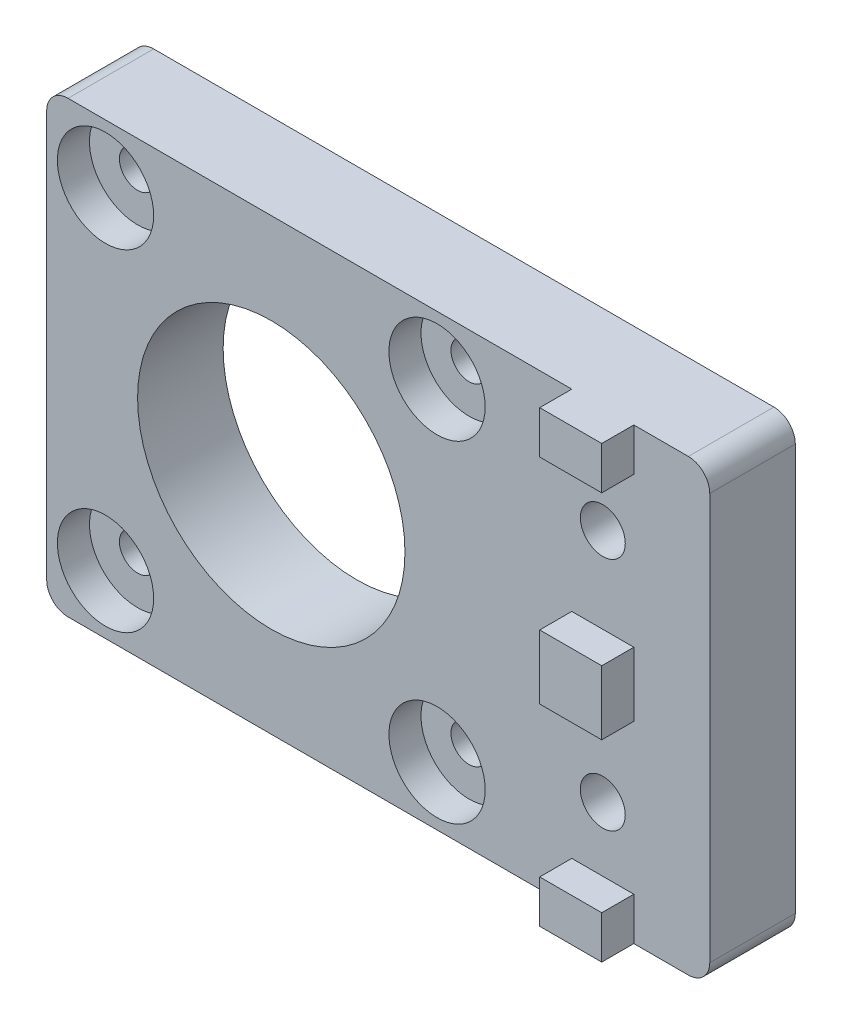
ISO-10303-21;
HEADER;
FILE_DESCRIPTION(('STEP AP214'),'2;1');
FILE_NAME('part.step','',(''),(''),'','','');
FILE_SCHEMA(('AUTOMOTIVE_DESIGN { 1 0 10303 214 1 1 1 1 }'));
ENDSEC;
DATA;
#1=APPLICATION_CONTEXT('core data for automotive mechanical design processes');
#2=APPLICATION_PROTOCOL_DEFINITION('international standard','automotive_design',2000,#1);
#3=PRODUCT_CONTEXT('',#1,'mechanical');
#4=PRODUCT('Part','Part','',(#3));
#5=PRODUCT_RELATED_PRODUCT_CATEGORY('part','',(#4));
#6=PRODUCT_DEFINITION_FORMATION('','',#4);
#7=PRODUCT_DEFINITION_CONTEXT('part definition',#1,'design');
#8=PRODUCT_DEFINITION('design','',#6,#7);
#9=PRODUCT_DEFINITION_SHAPE('','',#8);
#10=(LENGTH_UNIT() NAMED_UNIT(*) SI_UNIT(.MILLI.,.METRE.));
#11=(NAMED_UNIT(*) PLANE_ANGLE_UNIT() SI_UNIT($,.RADIAN.));
#12=(NAMED_UNIT(*) SI_UNIT($,.STERADIAN.) SOLID_ANGLE_UNIT());
#13=UNCERTAINTY_MEASURE_WITH_UNIT(LENGTH_MEASURE(1.E-05),#10,'distance_accuracy_value','');
#14=(GEOMETRIC_REPRESENTATION_CONTEXT(3) GLOBAL_UNCERTAINTY_ASSIGNED_CONTEXT((#13)) GLOBAL_UNIT_ASSIGNED_CONTEXT((#10,
#11,#12)) REPRESENTATION_CONTEXT('',''));
#15=CARTESIAN_POINT('',(0.,0.,0.));
#16=DIRECTION('',(0.,0.,1.));
#17=DIRECTION('',(1.,0.,0.));
#18=AXIS2_PLACEMENT_3D('',#15,#16,#17);
#19=CARTESIAN_POINT('',(5.5,15.5,0.));
#20=DIRECTION('',(0.,0.,1.));
#21=DIRECTION('',(1.,0.,0.));
#22=AXIS2_PLACEMENT_3D('',#19,#20,#21);
#23=CYLINDRICAL_SURFACE('',#22,1.7);
#24=CARTESIAN_POINT('',(5.5,15.5,0.));
#25=DIRECTION('',(0.,0.,1.));
#26=DIRECTION('',(1.,0.,0.));
#27=AXIS2_PLACEMENT_3D('',#24,#25,#26);
#28=CIRCLE('',#27,1.7);
#29=CARTESIAN_POINT('',(7.2,15.5,0.));
#30=VERTEX_POINT('',#29);
#31=EDGE_CURVE('E832',#30,#30,#28,.T.);
#32=ORIENTED_EDGE('',*,*,#31,.F.);
#33=EDGE_LOOP('',(#32));
#34=FACE_BOUND('',#33,.T.);
#35=CARTESIAN_POINT('',(5.5,15.5,5.));
#36=DIRECTION('',(0.,0.,1.));
#37=DIRECTION('',(1.,0.,0.));
#38=AXIS2_PLACEMENT_3D('',#35,#36,#37);
#39=CIRCLE('',#38,1.7);
#40=CARTESIAN_POINT('',(7.2,15.5,5.));
#41=VERTEX_POINT('',#40);
#42=EDGE_CURVE('E38',#41,#41,#39,.F.);
#43=ORIENTED_EDGE('',*,*,#42,.F.);
#44=EDGE_LOOP('',(#43));
#45=FACE_BOUND('',#44,.T.);
#46=ADVANCED_FACE('F34',(#34,#45),#23,.F.);
#47=CARTESIAN_POINT('',(5.5,-15.5,0.));
#48=DIRECTION('',(0.,0.,1.));
#49=DIRECTION('',(1.,0.,0.));
#50=AXIS2_PLACEMENT_3D('',#47,#48,#49);
#51=CYLINDRICAL_SURFACE('',#50,1.7);
#52=CARTESIAN_POINT('',(5.5,-15.5,0.));
#53=DIRECTION('',(0.,0.,1.));
#54=DIRECTION('',(1.,0.,0.));
#55=AXIS2_PLACEMENT_3D('',#52,#53,#54);
#56=CIRCLE('',#55,1.7);
#57=CARTESIAN_POINT('',(7.2,-15.5,0.));
#58=VERTEX_POINT('',#57);
#59=EDGE_CURVE('E827',#58,#58,#56,.T.);
#60=ORIENTED_EDGE('',*,*,#59,.F.);
#61=EDGE_LOOP('',(#60));
#62=FACE_BOUND('',#61,.T.);
#63=CARTESIAN_POINT('',(5.5,-15.5,5.));
#64=DIRECTION('',(0.,0.,1.));
#65=DIRECTION('',(1.,0.,0.));
#66=AXIS2_PLACEMENT_3D('',#63,#64,#65);
#67=CIRCLE('',#66,1.7);
#68=CARTESIAN_POINT('',(7.2,-15.5,5.));
#69=VERTEX_POINT('',#68);
#70=EDGE_CURVE('E339',#69,#69,#67,.F.);
#71=ORIENTED_EDGE('',*,*,#70,.F.);
#72=EDGE_LOOP('',(#71));
#73=FACE_BOUND('',#72,.T.);
#74=ADVANCED_FACE('F402',(#62,#73),#51,.F.);
#75=CARTESIAN_POINT('',(-25.5,-15.5,0.));
#76=DIRECTION('',(0.,0.,1.));
#77=DIRECTION('',(1.,0.,0.));
#78=AXIS2_PLACEMENT_3D('',#75,#76,#77);
#79=CYLINDRICAL_SURFACE('',#78,1.7);
#80=CARTESIAN_POINT('',(-25.5,-15.5,0.));
#81=DIRECTION('',(0.,0.,1.));
#82=DIRECTION('',(1.,0.,0.));
#83=AXIS2_PLACEMENT_3D('',#80,#81,#82);
#84=CIRCLE('',#83,1.7);
#85=CARTESIAN_POINT('',(-23.8,-15.5,0.));
#86=VERTEX_POINT('',#85);
#87=EDGE_CURVE('E526',#86,#86,#84,.T.);
#88=ORIENTED_EDGE('',*,*,#87,.F.);
#89=EDGE_LOOP('',(#88));
#90=FACE_BOUND('',#89,.T.);
#91=CARTESIAN_POINT('',(-25.5,-15.5,5.));
#92=DIRECTION('',(0.,0.,1.));
#93=DIRECTION('',(1.,0.,0.));
#94=AXIS2_PLACEMENT_3D('',#91,#92,#93);
#95=CIRCLE('',#94,1.7);
#96=CARTESIAN_POINT('',(-23.8,-15.5,5.));
#97=VERTEX_POINT('',#96);
#98=EDGE_CURVE('E335',#97,#97,#95,.F.);
#99=ORIENTED_EDGE('',*,*,#98,.F.);
#100=EDGE_LOOP('',(#99));
#101=FACE_BOUND('',#100,.T.);
#102=ADVANCED_FACE('F394',(#90,#101),#79,.F.);
#103=CARTESIAN_POINT('',(-25.5,15.5,0.));
#104=DIRECTION('',(0.,0.,1.));
#105=DIRECTION('',(1.,0.,0.));
#106=AXIS2_PLACEMENT_3D('',#103,#104,#105);
#107=CYLINDRICAL_SURFACE('',#106,1.7);
#108=CARTESIAN_POINT('',(-25.5,15.5,0.));
#109=DIRECTION('',(0.,0.,1.));
#110=DIRECTION('',(1.,0.,0.));
#111=AXIS2_PLACEMENT_3D('',#108,#109,#110);
#112=CIRCLE('',#111,1.7);
#113=CARTESIAN_POINT('',(-23.8,15.5,0.));
#114=VERTEX_POINT('',#113);
#115=EDGE_CURVE('E835',#114,#114,#112,.T.);
#116=ORIENTED_EDGE('',*,*,#115,.F.);
#117=EDGE_LOOP('',(#116));
#118=FACE_BOUND('',#117,.T.);
#119=CARTESIAN_POINT('',(-25.5,15.5,5.));
#120=DIRECTION('',(0.,0.,1.));
#121=DIRECTION('',(1.,0.,0.));
#122=AXIS2_PLACEMENT_3D('',#119,#120,#121);
#123=CIRCLE('',#122,1.7);
#124=CARTESIAN_POINT('',(-23.8,15.5,5.));
#125=VERTEX_POINT('',#124);
#126=EDGE_CURVE('E331',#125,#125,#123,.F.);
#127=ORIENTED_EDGE('',*,*,#126,.F.);
#128=EDGE_LOOP('',(#127));
#129=FACE_BOUND('',#128,.T.);
#130=ADVANCED_FACE('F384',(#118,#129),#107,.F.);
#131=CARTESIAN_POINT('',(0.,0.,8.));
#132=DIRECTION('',(0.,0.,1.));
#133=DIRECTION('',(1.,0.,0.));
#134=AXIS2_PLACEMENT_3D('',#131,#132,#133);
#135=PLANE('',#134);
#136=CARTESIAN_POINT('',(5.5,15.5,8.));
#137=DIRECTION('',(0.,0.,1.));
#138=DIRECTION('',(1.,0.,0.));
#139=AXIS2_PLACEMENT_3D('',#136,#137,#138);
#140=CIRCLE('',#139,4.5);
#141=CARTESIAN_POINT('',(10.,15.5,8.));
#142=VERTEX_POINT('',#141);
#143=EDGE_CURVE('E355',#142,#142,#140,.T.);
#144=ORIENTED_EDGE('',*,*,#143,.F.);
#145=EDGE_LOOP('',(#144));
#146=FACE_BOUND('',#145,.T.);
#147=CARTESIAN_POINT('',(5.5,-15.5,8.));
#148=DIRECTION('',(0.,0.,1.));
#149=DIRECTION('',(1.,0.,0.));
#150=AXIS2_PLACEMENT_3D('',#147,#148,#149);
#151=CIRCLE('',#150,4.5);
#152=CARTESIAN_POINT('',(10.,-15.5,8.));
#153=VERTEX_POINT('',#152);
#154=EDGE_CURVE('E348',#153,#153,#151,.T.);
#155=ORIENTED_EDGE('',*,*,#154,.F.);
#156=EDGE_LOOP('',(#155));
#157=FACE_BOUND('',#156,.T.);
#158=CARTESIAN_POINT('',(-25.5,-15.5,8.));
#159=DIRECTION('',(0.,0.,1.));
#160=DIRECTION('',(1.,0.,0.));
#161=AXIS2_PLACEMENT_3D('',#158,#159,#160);
#162=CIRCLE('',#161,4.5);
#163=CARTESIAN_POINT('',(-21.,-15.5,8.));
#164=VERTEX_POINT('',#163);
#165=EDGE_CURVE('E341',#164,#164,#162,.T.);
#166=ORIENTED_EDGE('',*,*,#165,.F.);
#167=EDGE_LOOP('',(#166));
#168=FACE_BOUND('',#167,.T.);
#169=CARTESIAN_POINT('',(-25.5,15.5,8.));
#170=DIRECTION('',(0.,0.,1.));
#171=DIRECTION('',(1.,0.,0.));
#172=AXIS2_PLACEMENT_3D('',#169,#170,#171);
#173=CIRCLE('',#172,4.5);
#174=CARTESIAN_POINT('',(-21.,15.5,8.));
#175=VERTEX_POINT('',#174);
#176=EDGE_CURVE('E337',#175,#175,#173,.T.);
#177=ORIENTED_EDGE('',*,*,#176,.F.);
#178=EDGE_LOOP('',(#177));
#179=FACE_BOUND('',#178,.T.);
#180=DIRECTION('',(-1.,0.,0.));
#181=VECTOR('',#180,1.);
#182=CARTESIAN_POINT('',(-31.,21.,8.));
#183=LINE('',#182,#181);
#184=CARTESIAN_POINT('',(18.1,21.,8.));
#185=VERTEX_POINT('',#184);
#186=CARTESIAN_POINT('',(-29.,21.,8.));
#187=VERTEX_POINT('',#186);
#188=EDGE_CURVE('E277',#185,#187,#183,.T.);
#189=ORIENTED_EDGE('',*,*,#188,.T.);
#190=CARTESIAN_POINT('',(-29.,19.,8.));
#191=DIRECTION('',(0.,0.,1.));
#192=DIRECTION('',(1.,0.,0.));
#193=AXIS2_PLACEMENT_3D('',#190,#191,#192);
#194=CIRCLE('',#193,2.);
#195=CARTESIAN_POINT('',(-31.,19.,8.));
#196=VERTEX_POINT('',#195);
#197=EDGE_CURVE('E313',#187,#196,#194,.T.);
#198=ORIENTED_EDGE('',*,*,#197,.T.);
#199=DIRECTION('',(0.,-1.,0.));
#200=VECTOR('',#199,1.);
#201=CARTESIAN_POINT('',(-31.,21.,8.));
#202=LINE('',#201,#200);
#203=CARTESIAN_POINT('',(-31.,-19.,8.));
#204=VERTEX_POINT('',#203);
#205=EDGE_CURVE('E445',#196,#204,#202,.T.);
#206=ORIENTED_EDGE('',*,*,#205,.T.);
#207=CARTESIAN_POINT('',(-29.,-19.,8.));
#208=DIRECTION('',(0.,0.,1.));
#209=DIRECTION('',(1.,0.,0.));
#210=AXIS2_PLACEMENT_3D('',#207,#208,#209);
#211=CIRCLE('',#210,2.);
#212=CARTESIAN_POINT('',(-29.,-21.,8.));
#213=VERTEX_POINT('',#212);
#214=EDGE_CURVE('E319',#204,#213,#211,.T.);
#215=ORIENTED_EDGE('',*,*,#214,.T.);
#216=DIRECTION('',(1.,0.,0.));
#217=VECTOR('',#216,1.);
#218=CARTESIAN_POINT('',(-31.,-21.,8.));
#219=LINE('',#218,#217);
#220=CARTESIAN_POINT('',(18.1,-21.,8.));
#221=VERTEX_POINT('',#220);
#222=EDGE_CURVE('E447',#213,#221,#219,.T.);
#223=ORIENTED_EDGE('',*,*,#222,.T.);
#224=DIRECTION('',(0.,-1.,0.));
#225=VECTOR('',#224,1.);
#226=CARTESIAN_POINT('',(18.1,-21.,8.));
#227=LINE('',#226,#225);
#228=CARTESIAN_POINT('',(18.1,-17.,8.));
#229=VERTEX_POINT('',#228);
#230=EDGE_CURVE('E198',#229,#221,#227,.T.);
#231=ORIENTED_EDGE('',*,*,#230,.F.);
#232=DIRECTION('',(-1.,0.,0.));
#233=VECTOR('',#232,1.);
#234=CARTESIAN_POINT('',(18.1,-17.,8.));
#235=LINE('',#234,#233);
#236=CARTESIAN_POINT('',(23.9,-17.,8.));
#237=VERTEX_POINT('',#236);
#238=EDGE_CURVE('E211',#237,#229,#235,.T.);
#239=ORIENTED_EDGE('',*,*,#238,.F.);
#240=DIRECTION('',(0.,1.,0.));
#241=VECTOR('',#240,1.);
#242=CARTESIAN_POINT('',(23.9,-21.,8.));
#243=LINE('',#242,#241);
#244=CARTESIAN_POINT('',(23.9,-21.,8.));
#245=VERTEX_POINT('',#244);
#246=EDGE_CURVE('E201',#245,#237,#243,.T.);
#247=ORIENTED_EDGE('',*,*,#246,.F.);
#248=CARTESIAN_POINT('',(29.,-21.,8.));
#249=VERTEX_POINT('',#248);
#250=EDGE_CURVE('E446',#245,#249,#219,.T.);
#251=ORIENTED_EDGE('',*,*,#250,.T.);
#252=CARTESIAN_POINT('',(29.,-19.,8.));
#253=DIRECTION('',(0.,0.,1.));
#254=DIRECTION('',(1.,0.,0.));
#255=AXIS2_PLACEMENT_3D('',#252,#253,#254);
#256=CIRCLE('',#255,2.);
#257=CARTESIAN_POINT('',(31.,-19.,8.));
#258=VERTEX_POINT('',#257);
#259=EDGE_CURVE('E56',#249,#258,#256,.T.);
#260=ORIENTED_EDGE('',*,*,#259,.T.);
#261=DIRECTION('',(0.,1.,0.));
#262=VECTOR('',#261,1.);
#263=CARTESIAN_POINT('',(31.,21.,8.));
#264=LINE('',#263,#262);
#265=CARTESIAN_POINT('',(31.,19.,8.));
#266=VERTEX_POINT('',#265);
#267=EDGE_CURVE('E282',#258,#266,#264,.T.);
#268=ORIENTED_EDGE('',*,*,#267,.T.);
#269=CARTESIAN_POINT('',(29.,19.,8.));
#270=DIRECTION('',(0.,0.,1.));
#271=DIRECTION('',(1.,0.,0.));
#272=AXIS2_PLACEMENT_3D('',#269,#270,#271);
#273=CIRCLE('',#272,2.);
#274=CARTESIAN_POINT('',(29.,21.,8.));
#275=VERTEX_POINT('',#274);
#276=EDGE_CURVE('E323',#266,#275,#273,.T.);
#277=ORIENTED_EDGE('',*,*,#276,.T.);
#278=CARTESIAN_POINT('',(23.9,21.,8.));
#279=VERTEX_POINT('',#278);
#280=EDGE_CURVE('E263',#275,#279,#183,.T.);
#281=ORIENTED_EDGE('',*,*,#280,.T.);
#282=DIRECTION('',(0.,1.,0.));
#283=VECTOR('',#282,1.);
#284=CARTESIAN_POINT('',(23.9,21.,8.));
#285=LINE('',#284,#283);
#286=CARTESIAN_POINT('',(23.9,17.,8.));
#287=VERTEX_POINT('',#286);
#288=EDGE_CURVE('E235',#287,#279,#285,.T.);
#289=ORIENTED_EDGE('',*,*,#288,.F.);
#290=DIRECTION('',(1.,0.,0.));
#291=VECTOR('',#290,1.);
#292=CARTESIAN_POINT('',(18.1,17.,8.));
#293=LINE('',#292,#291);
#294=CARTESIAN_POINT('',(18.1,17.,8.));
#295=VERTEX_POINT('',#294);
#296=EDGE_CURVE('E242',#295,#287,#293,.T.);
#297=ORIENTED_EDGE('',*,*,#296,.F.);
#298=DIRECTION('',(0.,-1.,0.));
#299=VECTOR('',#298,1.);
#300=CARTESIAN_POINT('',(18.1,21.,8.));
#301=LINE('',#300,#299);
#302=EDGE_CURVE('E230',#185,#295,#301,.T.);
#303=ORIENTED_EDGE('',*,*,#302,.F.);
#304=EDGE_LOOP('',(#189,#198,#206,#215,#223,#231,#239,#247,#251,#260,#268,#277,#281,#289,#297,#303));
#305=FACE_BOUND('',#304,.T.);
#306=CARTESIAN_POINT('',(-10.,0.,8.));
#307=DIRECTION('',(0.,0.,1.));
#308=DIRECTION('',(1.,0.,0.));
#309=AXIS2_PLACEMENT_3D('',#306,#307,#308);
#310=CIRCLE('',#309,12.5);
#311=CARTESIAN_POINT('',(2.5,0.,8.));
#312=VERTEX_POINT('',#311);
#313=EDGE_CURVE('E838',#312,#312,#310,.T.);
#314=ORIENTED_EDGE('',*,*,#313,.F.);
#315=EDGE_LOOP('',(#314));
#316=FACE_BOUND('',#315,.T.);
#317=CARTESIAN_POINT('',(21.,-11.,8.));
#318=DIRECTION('',(0.,0.,1.));
#319=DIRECTION('',(1.,0.,0.));
#320=AXIS2_PLACEMENT_3D('',#317,#318,#319);
#321=CIRCLE('',#320,2.1);
#322=CARTESIAN_POINT('',(23.1,-11.,8.));
#323=VERTEX_POINT('',#322);
#324=EDGE_CURVE('E441',#323,#323,#321,.T.);
#325=ORIENTED_EDGE('',*,*,#324,.F.);
#326=EDGE_LOOP('',(#325));
#327=FACE_BOUND('',#326,.T.);
#328=CARTESIAN_POINT('',(21.,11.,8.));
#329=DIRECTION('',(0.,0.,1.));
#330=DIRECTION('',(1.,0.,0.));
#331=AXIS2_PLACEMENT_3D('',#328,#329,#330);
#332=CIRCLE('',#331,2.1);
#333=CARTESIAN_POINT('',(23.1,11.,8.));
#334=VERTEX_POINT('',#333);
#335=EDGE_CURVE('E435',#334,#334,#332,.T.);
#336=ORIENTED_EDGE('',*,*,#335,.F.);
#337=EDGE_LOOP('',(#336));
#338=FACE_BOUND('',#337,.T.);
#339=DIRECTION('',(1.,0.,0.));
#340=VECTOR('',#339,1.);
#341=CARTESIAN_POINT('',(18.1,-3.,8.));
#342=LINE('',#341,#340);
#343=CARTESIAN_POINT('',(18.1,-3.,8.));
#344=VERTEX_POINT('',#343);
#345=CARTESIAN_POINT('',(23.9,-3.,8.));
#346=VERTEX_POINT('',#345);
#347=EDGE_CURVE('E368',#344,#346,#342,.T.);
#348=ORIENTED_EDGE('',*,*,#347,.F.);
#349=DIRECTION('',(0.,-1.,0.));
#350=VECTOR('',#349,1.);
#351=CARTESIAN_POINT('',(18.1,-3.,8.));
#352=LINE('',#351,#350);
#353=CARTESIAN_POINT('',(18.1,3.,8.));
#354=VERTEX_POINT('',#353);
#355=EDGE_CURVE('E196',#354,#344,#352,.T.);
#356=ORIENTED_EDGE('',*,*,#355,.F.);
#357=DIRECTION('',(-1.,0.,0.));
#358=VECTOR('',#357,1.);
#359=CARTESIAN_POINT('',(18.1,3.,8.));
#360=LINE('',#359,#358);
#361=CARTESIAN_POINT('',(23.9,3.,8.));
#362=VERTEX_POINT('',#361);
#363=EDGE_CURVE('E192',#362,#354,#360,.T.);
#364=ORIENTED_EDGE('',*,*,#363,.F.);
#365=DIRECTION('',(0.,1.,0.));
#366=VECTOR('',#365,1.);
#367=CARTESIAN_POINT('',(23.9,-3.,8.));
#368=LINE('',#367,#366);
#369=EDGE_CURVE('E370',#346,#362,#368,.T.);
#370=ORIENTED_EDGE('',*,*,#369,.F.);
#371=EDGE_LOOP('',(#348,#356,#364,#370));
#372=FACE_BOUND('',#371,.T.);
#373=ADVANCED_FACE('F310',(#146,#157,#168,#179,#305,#316,#327,#338,#372),#135,.T.);
#374=CARTESIAN_POINT('',(-31.,21.,8.));
#375=DIRECTION('',(1.,0.,0.));
#376=DIRECTION('',(0.,1.,0.));
#377=AXIS2_PLACEMENT_3D('',#374,#375,#376);
#378=PLANE('',#377);
#379=ORIENTED_EDGE('',*,*,#205,.F.);
#380=DIRECTION('',(0.,0.,-1.));
#381=VECTOR('',#380,1.);
#382=CARTESIAN_POINT('',(-31.,19.,8.));
#383=LINE('',#382,#381);
#384=CARTESIAN_POINT('',(-31.,19.,0.));
#385=VERTEX_POINT('',#384);
#386=EDGE_CURVE('E262',#196,#385,#383,.T.);
#387=ORIENTED_EDGE('',*,*,#386,.T.);
#388=DIRECTION('',(0.,-1.,0.));
#389=VECTOR('',#388,1.);
#390=CARTESIAN_POINT('',(-31.,21.,0.));
#391=LINE('',#390,#389);
#392=CARTESIAN_POINT('',(-31.,-19.,0.));
#393=VERTEX_POINT('',#392);
#394=EDGE_CURVE('E284',#385,#393,#391,.T.);
#395=ORIENTED_EDGE('',*,*,#394,.T.);
#396=DIRECTION('',(0.,0.,-1.));
#397=VECTOR('',#396,1.);
#398=CARTESIAN_POINT('',(-31.,-19.,8.));
#399=LINE('',#398,#397);
#400=EDGE_CURVE('E260',#393,#204,#399,.F.);
#401=ORIENTED_EDGE('',*,*,#400,.T.);
#402=EDGE_LOOP('',(#379,#387,#395,#401));
#403=FACE_BOUND('',#402,.T.);
#404=ADVANCED_FACE('F383',(#403),#378,.F.);
#405=CARTESIAN_POINT('',(-31.,-21.,8.));
#406=DIRECTION('',(0.,1.,0.));
#407=DIRECTION('',(0.,0.,1.));
#408=AXIS2_PLACEMENT_3D('',#405,#406,#407);
#409=PLANE('',#408);
#410=ORIENTED_EDGE('',*,*,#222,.F.);
#411=DIRECTION('',(0.,0.,-1.));
#412=VECTOR('',#411,1.);
#413=CARTESIAN_POINT('',(-29.,-21.,8.));
#414=LINE('',#413,#412);
#415=CARTESIAN_POINT('',(-29.,-21.,0.));
#416=VERTEX_POINT('',#415);
#417=EDGE_CURVE('E321',#213,#416,#414,.T.);
#418=ORIENTED_EDGE('',*,*,#417,.T.);
#419=DIRECTION('',(1.,0.,0.));
#420=VECTOR('',#419,1.);
#421=CARTESIAN_POINT('',(-31.,-21.,0.));
#422=LINE('',#421,#420);
#423=CARTESIAN_POINT('',(29.,-21.,0.));
#424=VERTEX_POINT('',#423);
#425=EDGE_CURVE('E469',#416,#424,#422,.T.);
#426=ORIENTED_EDGE('',*,*,#425,.T.);
#427=DIRECTION('',(0.,0.,-1.));
#428=VECTOR('',#427,1.);
#429=CARTESIAN_POINT('',(29.,-21.,8.));
#430=LINE('',#429,#428);
#431=EDGE_CURVE('E318',#424,#249,#430,.F.);
#432=ORIENTED_EDGE('',*,*,#431,.T.);
#433=ORIENTED_EDGE('',*,*,#250,.F.);
#434=DIRECTION('',(0.,0.,-1.));
#435=VECTOR('',#434,1.);
#436=CARTESIAN_POINT('',(23.9,-21.,11.));
#437=LINE('',#436,#435);
#438=CARTESIAN_POINT('',(23.9,-21.,11.));
#439=VERTEX_POINT('',#438);
#440=EDGE_CURVE('E225',#439,#245,#437,.T.);
#441=ORIENTED_EDGE('',*,*,#440,.F.);
#442=DIRECTION('',(1.,0.,0.));
#443=VECTOR('',#442,1.);
#444=CARTESIAN_POINT('',(18.1,-21.,11.));
#445=LINE('',#444,#443);
#446=CARTESIAN_POINT('',(18.1,-21.,11.));
#447=VERTEX_POINT('',#446);
#448=EDGE_CURVE('E210',#447,#439,#445,.T.);
#449=ORIENTED_EDGE('',*,*,#448,.F.);
#450=DIRECTION('',(0.,0.,-1.));
#451=VECTOR('',#450,1.);
#452=CARTESIAN_POINT('',(18.1,-21.,11.));
#453=LINE('',#452,#451);
#454=EDGE_CURVE('E227',#447,#221,#453,.T.);
#455=ORIENTED_EDGE('',*,*,#454,.T.);
#456=EDGE_LOOP('',(#410,#418,#426,#432,#433,#441,#449,#455));
#457=FACE_BOUND('',#456,.T.);
#458=ADVANCED_FACE('F391',(#457),#409,.F.);
#459=CARTESIAN_POINT('',(31.,21.,8.));
#460=DIRECTION('',(-1.,0.,0.));
#461=DIRECTION('',(0.,-1.,0.));
#462=AXIS2_PLACEMENT_3D('',#459,#460,#461);
#463=PLANE('',#462);
#464=DIRECTION('',(0.,1.,0.));
#465=VECTOR('',#464,1.);
#466=CARTESIAN_POINT('',(31.,21.,0.));
#467=LINE('',#466,#465);
#468=CARTESIAN_POINT('',(31.,-19.,0.));
#469=VERTEX_POINT('',#468);
#470=CARTESIAN_POINT('',(31.,19.,0.));
#471=VERTEX_POINT('',#470);
#472=EDGE_CURVE('E468',#469,#471,#467,.T.);
#473=ORIENTED_EDGE('',*,*,#472,.T.);
#474=DIRECTION('',(0.,0.,-1.));
#475=VECTOR('',#474,1.);
#476=CARTESIAN_POINT('',(31.,19.,8.));
#477=LINE('',#476,#475);
#478=EDGE_CURVE('E11',#471,#266,#477,.F.);
#479=ORIENTED_EDGE('',*,*,#478,.T.);
#480=ORIENTED_EDGE('',*,*,#267,.F.);
#481=DIRECTION('',(0.,0.,-1.));
#482=VECTOR('',#481,1.);
#483=CARTESIAN_POINT('',(31.,-19.,8.));
#484=LINE('',#483,#482);
#485=EDGE_CURVE('E43',#258,#469,#484,.T.);
#486=ORIENTED_EDGE('',*,*,#485,.T.);
#487=EDGE_LOOP('',(#473,#479,#480,#486));
#488=FACE_BOUND('',#487,.T.);
#489=ADVANCED_FACE('F759',(#488),#463,.F.);
#490=CARTESIAN_POINT('',(-31.,21.,8.));
#491=DIRECTION('',(0.,-1.,0.));
#492=DIRECTION('',(1.,0.,0.));
#493=AXIS2_PLACEMENT_3D('',#490,#491,#492);
#494=PLANE('',#493);
#495=DIRECTION('',(-1.,0.,0.));
#496=VECTOR('',#495,1.);
#497=CARTESIAN_POINT('',(-31.,21.,0.));
#498=LINE('',#497,#496);
#499=CARTESIAN_POINT('',(29.,21.,0.));
#500=VERTEX_POINT('',#499);
#501=CARTESIAN_POINT('',(-29.,21.,0.));
#502=VERTEX_POINT('',#501);
#503=EDGE_CURVE('E291',#500,#502,#498,.T.);
#504=ORIENTED_EDGE('',*,*,#503,.T.);
#505=DIRECTION('',(0.,0.,-1.));
#506=VECTOR('',#505,1.);
#507=CARTESIAN_POINT('',(-29.,21.,8.));
#508=LINE('',#507,#506);
#509=EDGE_CURVE('E308',#502,#187,#508,.F.);
#510=ORIENTED_EDGE('',*,*,#509,.T.);
#511=ORIENTED_EDGE('',*,*,#188,.F.);
#512=DIRECTION('',(0.,0.,-1.));
#513=VECTOR('',#512,1.);
#514=CARTESIAN_POINT('',(18.1,21.,11.));
#515=LINE('',#514,#513);
#516=CARTESIAN_POINT('',(18.1,21.,11.));
#517=VERTEX_POINT('',#516);
#518=EDGE_CURVE('E241',#517,#185,#515,.T.);
#519=ORIENTED_EDGE('',*,*,#518,.F.);
#520=DIRECTION('',(-1.,0.,0.));
#521=VECTOR('',#520,1.);
#522=CARTESIAN_POINT('',(18.1,21.,11.));
#523=LINE('',#522,#521);
#524=CARTESIAN_POINT('',(23.9,21.,11.));
#525=VERTEX_POINT('',#524);
#526=EDGE_CURVE('E239',#525,#517,#523,.T.);
#527=ORIENTED_EDGE('',*,*,#526,.F.);
#528=DIRECTION('',(0.,0.,-1.));
#529=VECTOR('',#528,1.);
#530=CARTESIAN_POINT('',(23.9,21.,11.));
#531=LINE('',#530,#529);
#532=EDGE_CURVE('E255',#525,#279,#531,.T.);
#533=ORIENTED_EDGE('',*,*,#532,.T.);
#534=ORIENTED_EDGE('',*,*,#280,.F.);
#535=DIRECTION('',(0.,0.,-1.));
#536=VECTOR('',#535,1.);
#537=CARTESIAN_POINT('',(29.,21.,8.));
#538=LINE('',#537,#536);
#539=EDGE_CURVE('E274',#275,#500,#538,.T.);
#540=ORIENTED_EDGE('',*,*,#539,.T.);
#541=EDGE_LOOP('',(#504,#510,#511,#519,#527,#533,#534,#540));
#542=FACE_BOUND('',#541,.T.);
#543=ADVANCED_FACE('F306',(#542),#494,.F.);
#544=CARTESIAN_POINT('',(0.,0.,0.));
#545=DIRECTION('',(0.,0.,1.));
#546=DIRECTION('',(1.,0.,0.));
#547=AXIS2_PLACEMENT_3D('',#544,#545,#546);
#548=PLANE('',#547);
#549=ORIENTED_EDGE('',*,*,#87,.T.);
#550=EDGE_LOOP('',(#549));
#551=FACE_BOUND('',#550,.T.);
#552=ORIENTED_EDGE('',*,*,#59,.T.);
#553=EDGE_LOOP('',(#552));
#554=FACE_BOUND('',#553,.T.);
#555=ORIENTED_EDGE('',*,*,#31,.T.);
#556=EDGE_LOOP('',(#555));
#557=FACE_BOUND('',#556,.T.);
#558=ORIENTED_EDGE('',*,*,#115,.T.);
#559=EDGE_LOOP('',(#558));
#560=FACE_BOUND('',#559,.T.);
#561=CARTESIAN_POINT('',(-10.,0.,0.));
#562=DIRECTION('',(0.,0.,1.));
#563=DIRECTION('',(1.,0.,0.));
#564=AXIS2_PLACEMENT_3D('',#561,#562,#563);
#565=CIRCLE('',#564,12.5);
#566=CARTESIAN_POINT('',(2.5,0.,0.));
#567=VERTEX_POINT('',#566);
#568=EDGE_CURVE('E839',#567,#567,#565,.T.);
#569=ORIENTED_EDGE('',*,*,#568,.T.);
#570=EDGE_LOOP('',(#569));
#571=FACE_BOUND('',#570,.T.);
#572=CARTESIAN_POINT('',(21.,-11.,0.));
#573=DIRECTION('',(0.,0.,1.));
#574=DIRECTION('',(1.,0.,0.));
#575=AXIS2_PLACEMENT_3D('',#572,#573,#574);
#576=CIRCLE('',#575,2.1);
#577=CARTESIAN_POINT('',(23.1,-11.,0.));
#578=VERTEX_POINT('',#577);
#579=EDGE_CURVE('E437',#578,#578,#576,.T.);
#580=ORIENTED_EDGE('',*,*,#579,.T.);
#581=EDGE_LOOP('',(#580));
#582=FACE_BOUND('',#581,.T.);
#583=CARTESIAN_POINT('',(21.,11.,0.));
#584=DIRECTION('',(0.,0.,1.));
#585=DIRECTION('',(1.,0.,0.));
#586=AXIS2_PLACEMENT_3D('',#583,#584,#585);
#587=CIRCLE('',#586,2.1);
#588=CARTESIAN_POINT('',(23.1,11.,0.));
#589=VERTEX_POINT('',#588);
#590=EDGE_CURVE('E432',#589,#589,#587,.T.);
#591=ORIENTED_EDGE('',*,*,#590,.T.);
#592=EDGE_LOOP('',(#591));
#593=FACE_BOUND('',#592,.T.);
#594=ORIENTED_EDGE('',*,*,#394,.F.);
#595=CARTESIAN_POINT('',(-29.,19.,0.));
#596=DIRECTION('',(0.,0.,1.));
#597=DIRECTION('',(1.,0.,0.));
#598=AXIS2_PLACEMENT_3D('',#595,#596,#597);
#599=CIRCLE('',#598,2.);
#600=EDGE_CURVE('E272',#385,#502,#599,.F.);
#601=ORIENTED_EDGE('',*,*,#600,.T.);
#602=ORIENTED_EDGE('',*,*,#503,.F.);
#603=CARTESIAN_POINT('',(29.,19.,0.));
#604=DIRECTION('',(0.,0.,1.));
#605=DIRECTION('',(1.,0.,0.));
#606=AXIS2_PLACEMENT_3D('',#603,#604,#605);
#607=CIRCLE('',#606,2.);
#608=EDGE_CURVE('E268',#500,#471,#607,.F.);
#609=ORIENTED_EDGE('',*,*,#608,.T.);
#610=ORIENTED_EDGE('',*,*,#472,.F.);
#611=CARTESIAN_POINT('',(29.,-19.,0.));
#612=DIRECTION('',(0.,0.,1.));
#613=DIRECTION('',(1.,0.,0.));
#614=AXIS2_PLACEMENT_3D('',#611,#612,#613);
#615=CIRCLE('',#614,2.);
#616=EDGE_CURVE('E266',#469,#424,#615,.F.);
#617=ORIENTED_EDGE('',*,*,#616,.T.);
#618=ORIENTED_EDGE('',*,*,#425,.F.);
#619=CARTESIAN_POINT('',(-29.,-19.,0.));
#620=DIRECTION('',(0.,0.,1.));
#621=DIRECTION('',(1.,0.,0.));
#622=AXIS2_PLACEMENT_3D('',#619,#620,#621);
#623=CIRCLE('',#622,2.);
#624=EDGE_CURVE('E270',#416,#393,#623,.F.);
#625=ORIENTED_EDGE('',*,*,#624,.T.);
#626=EDGE_LOOP('',(#594,#601,#602,#609,#610,#617,#618,#625));
#627=FACE_BOUND('',#626,.T.);
#628=ADVANCED_FACE('F423',(#551,#554,#557,#560,#571,#582,#593,#627),#548,.F.);
#629=CARTESIAN_POINT('',(21.,11.,0.));
#630=DIRECTION('',(0.,0.,1.));
#631=DIRECTION('',(1.,0.,0.));
#632=AXIS2_PLACEMENT_3D('',#629,#630,#631);
#633=CYLINDRICAL_SURFACE('',#632,2.1);
#634=ORIENTED_EDGE('',*,*,#590,.F.);
#635=EDGE_LOOP('',(#634));
#636=FACE_BOUND('',#635,.T.);
#637=ORIENTED_EDGE('',*,*,#335,.T.);
#638=EDGE_LOOP('',(#637));
#639=FACE_BOUND('',#638,.T.);
#640=ADVANCED_FACE('F420',(#636,#639),#633,.F.);
#641=CARTESIAN_POINT('',(21.,-11.,0.));
#642=DIRECTION('',(0.,0.,1.));
#643=DIRECTION('',(1.,0.,0.));
#644=AXIS2_PLACEMENT_3D('',#641,#642,#643);
#645=CYLINDRICAL_SURFACE('',#644,2.1);
#646=ORIENTED_EDGE('',*,*,#579,.F.);
#647=EDGE_LOOP('',(#646));
#648=FACE_BOUND('',#647,.T.);
#649=ORIENTED_EDGE('',*,*,#324,.T.);
#650=EDGE_LOOP('',(#649));
#651=FACE_BOUND('',#650,.T.);
#652=ADVANCED_FACE('F417',(#648,#651),#645,.F.);
#653=CARTESIAN_POINT('',(-10.,0.,0.));
#654=DIRECTION('',(0.,0.,1.));
#655=DIRECTION('',(1.,0.,0.));
#656=AXIS2_PLACEMENT_3D('',#653,#654,#655);
#657=CYLINDRICAL_SURFACE('',#656,12.5);
#658=ORIENTED_EDGE('',*,*,#568,.F.);
#659=EDGE_LOOP('',(#658));
#660=FACE_BOUND('',#659,.T.);
#661=ORIENTED_EDGE('',*,*,#313,.T.);
#662=EDGE_LOOP('',(#661));
#663=FACE_BOUND('',#662,.T.);
#664=ADVANCED_FACE('F414',(#660,#663),#657,.F.);
#665=CARTESIAN_POINT('',(18.1,21.,11.));
#666=DIRECTION('',(1.,0.,0.));
#667=DIRECTION('',(0.,1.,0.));
#668=AXIS2_PLACEMENT_3D('',#665,#666,#667);
#669=PLANE('',#668);
#670=ORIENTED_EDGE('',*,*,#302,.T.);
#671=DIRECTION('',(0.,0.,-1.));
#672=VECTOR('',#671,1.);
#673=CARTESIAN_POINT('',(18.1,17.,11.));
#674=LINE('',#673,#672);
#675=CARTESIAN_POINT('',(18.1,17.,11.));
#676=VERTEX_POINT('',#675);
#677=EDGE_CURVE('E825',#676,#295,#674,.T.);
#678=ORIENTED_EDGE('',*,*,#677,.F.);
#679=DIRECTION('',(0.,-1.,0.));
#680=VECTOR('',#679,1.);
#681=CARTESIAN_POINT('',(18.1,21.,11.));
#682=LINE('',#681,#680);
#683=EDGE_CURVE('E231',#517,#676,#682,.T.);
#684=ORIENTED_EDGE('',*,*,#683,.F.);
#685=ORIENTED_EDGE('',*,*,#518,.T.);
#686=EDGE_LOOP('',(#670,#678,#684,#685));
#687=FACE_BOUND('',#686,.T.);
#688=ADVANCED_FACE('F300',(#687),#669,.F.);
#689=CARTESIAN_POINT('',(18.1,17.,11.));
#690=DIRECTION('',(0.,1.,0.));
#691=DIRECTION('',(0.,0.,1.));
#692=AXIS2_PLACEMENT_3D('',#689,#690,#691);
#693=PLANE('',#692);
#694=ORIENTED_EDGE('',*,*,#296,.T.);
#695=DIRECTION('',(0.,0.,-1.));
#696=VECTOR('',#695,1.);
#697=CARTESIAN_POINT('',(23.9,17.,11.));
#698=LINE('',#697,#696);
#699=CARTESIAN_POINT('',(23.9,17.,11.));
#700=VERTEX_POINT('',#699);
#701=EDGE_CURVE('E247',#700,#287,#698,.T.);
#702=ORIENTED_EDGE('',*,*,#701,.F.);
#703=DIRECTION('',(1.,0.,0.));
#704=VECTOR('',#703,1.);
#705=CARTESIAN_POINT('',(18.1,17.,11.));
#706=LINE('',#705,#704);
#707=EDGE_CURVE('E234',#676,#700,#706,.T.);
#708=ORIENTED_EDGE('',*,*,#707,.F.);
#709=ORIENTED_EDGE('',*,*,#677,.T.);
#710=EDGE_LOOP('',(#694,#702,#708,#709));
#711=FACE_BOUND('',#710,.T.);
#712=ADVANCED_FACE('F513',(#711),#693,.F.);
#713=CARTESIAN_POINT('',(23.9,21.,11.));
#714=DIRECTION('',(-1.,0.,0.));
#715=DIRECTION('',(0.,-1.,0.));
#716=AXIS2_PLACEMENT_3D('',#713,#714,#715);
#717=PLANE('',#716);
#718=ORIENTED_EDGE('',*,*,#288,.T.);
#719=ORIENTED_EDGE('',*,*,#532,.F.);
#720=DIRECTION('',(0.,1.,0.));
#721=VECTOR('',#720,1.);
#722=CARTESIAN_POINT('',(23.9,21.,11.));
#723=LINE('',#722,#721);
#724=EDGE_CURVE('E237',#700,#525,#723,.T.);
#725=ORIENTED_EDGE('',*,*,#724,.F.);
#726=ORIENTED_EDGE('',*,*,#701,.T.);
#727=EDGE_LOOP('',(#718,#719,#725,#726));
#728=FACE_BOUND('',#727,.T.);
#729=ADVANCED_FACE('F509',(#728),#717,.F.);
#730=CARTESIAN_POINT('',(0.,0.,11.));
#731=DIRECTION('',(0.,0.,1.));
#732=DIRECTION('',(1.,0.,0.));
#733=AXIS2_PLACEMENT_3D('',#730,#731,#732);
#734=PLANE('',#733);
#735=ORIENTED_EDGE('',*,*,#683,.T.);
#736=ORIENTED_EDGE('',*,*,#707,.T.);
#737=ORIENTED_EDGE('',*,*,#724,.T.);
#738=ORIENTED_EDGE('',*,*,#526,.T.);
#739=EDGE_LOOP('',(#735,#736,#737,#738));
#740=FACE_BOUND('',#739,.T.);
#741=ADVANCED_FACE('F506',(#740),#734,.T.);
#742=CARTESIAN_POINT('',(18.1,-21.,11.));
#743=DIRECTION('',(1.,0.,0.));
#744=DIRECTION('',(0.,1.,0.));
#745=AXIS2_PLACEMENT_3D('',#742,#743,#744);
#746=PLANE('',#745);
#747=ORIENTED_EDGE('',*,*,#230,.T.);
#748=ORIENTED_EDGE('',*,*,#454,.F.);
#749=DIRECTION('',(0.,-1.,0.));
#750=VECTOR('',#749,1.);
#751=CARTESIAN_POINT('',(18.1,-21.,11.));
#752=LINE('',#751,#750);
#753=CARTESIAN_POINT('',(18.1,-17.,11.));
#754=VERTEX_POINT('',#753);
#755=EDGE_CURVE('E207',#754,#447,#752,.T.);
#756=ORIENTED_EDGE('',*,*,#755,.F.);
#757=DIRECTION('',(0.,0.,-1.));
#758=VECTOR('',#757,1.);
#759=CARTESIAN_POINT('',(18.1,-17.,11.));
#760=LINE('',#759,#758);
#761=EDGE_CURVE('E216',#754,#229,#760,.T.);
#762=ORIENTED_EDGE('',*,*,#761,.T.);
#763=EDGE_LOOP('',(#747,#748,#756,#762));
#764=FACE_BOUND('',#763,.T.);
#765=ADVANCED_FACE('F481',(#764),#746,.F.);
#766=CARTESIAN_POINT('',(23.9,-21.,11.));
#767=DIRECTION('',(-1.,0.,0.));
#768=DIRECTION('',(0.,0.,1.));
#769=AXIS2_PLACEMENT_3D('',#766,#767,#768);
#770=PLANE('',#769);
#771=ORIENTED_EDGE('',*,*,#246,.T.);
#772=DIRECTION('',(0.,0.,-1.));
#773=VECTOR('',#772,1.);
#774=CARTESIAN_POINT('',(23.9,-17.,11.));
#775=LINE('',#774,#773);
#776=CARTESIAN_POINT('',(23.9,-17.,11.));
#777=VERTEX_POINT('',#776);
#778=EDGE_CURVE('E223',#777,#237,#775,.T.);
#779=ORIENTED_EDGE('',*,*,#778,.F.);
#780=DIRECTION('',(0.,1.,0.));
#781=VECTOR('',#780,1.);
#782=CARTESIAN_POINT('',(23.9,-21.,11.));
#783=LINE('',#782,#781);
#784=EDGE_CURVE('E213',#439,#777,#783,.T.);
#785=ORIENTED_EDGE('',*,*,#784,.F.);
#786=ORIENTED_EDGE('',*,*,#440,.T.);
#787=EDGE_LOOP('',(#771,#779,#785,#786));
#788=FACE_BOUND('',#787,.T.);
#789=ADVANCED_FACE('F489',(#788),#770,.F.);
#790=CARTESIAN_POINT('',(18.1,-17.,11.));
#791=DIRECTION('',(0.,-1.,0.));
#792=DIRECTION('',(0.,0.,-1.));
#793=AXIS2_PLACEMENT_3D('',#790,#791,#792);
#794=PLANE('',#793);
#795=ORIENTED_EDGE('',*,*,#238,.T.);
#796=ORIENTED_EDGE('',*,*,#761,.F.);
#797=DIRECTION('',(-1.,0.,0.));
#798=VECTOR('',#797,1.);
#799=CARTESIAN_POINT('',(18.1,-17.,11.));
#800=LINE('',#799,#798);
#801=EDGE_CURVE('E215',#777,#754,#800,.T.);
#802=ORIENTED_EDGE('',*,*,#801,.F.);
#803=ORIENTED_EDGE('',*,*,#778,.T.);
#804=EDGE_LOOP('',(#795,#796,#802,#803));
#805=FACE_BOUND('',#804,.T.);
#806=ADVANCED_FACE('F484',(#805),#794,.F.);
#807=CARTESIAN_POINT('',(0.,0.,11.));
#808=DIRECTION('',(0.,0.,-1.));
#809=DIRECTION('',(-1.,0.,0.));
#810=AXIS2_PLACEMENT_3D('',#807,#808,#809);
#811=PLANE('',#810);
#812=ORIENTED_EDGE('',*,*,#755,.T.);
#813=ORIENTED_EDGE('',*,*,#448,.T.);
#814=ORIENTED_EDGE('',*,*,#784,.T.);
#815=ORIENTED_EDGE('',*,*,#801,.T.);
#816=EDGE_LOOP('',(#812,#813,#814,#815));
#817=FACE_BOUND('',#816,.T.);
#818=ADVANCED_FACE('F491',(#817),#811,.F.);
#819=CARTESIAN_POINT('',(18.1,-3.,11.));
#820=DIRECTION('',(1.,0.,0.));
#821=DIRECTION('',(0.,0.,-1.));
#822=AXIS2_PLACEMENT_3D('',#819,#820,#821);
#823=PLANE('',#822);
#824=ORIENTED_EDGE('',*,*,#355,.T.);
#825=DIRECTION('',(0.,0.,-1.));
#826=VECTOR('',#825,1.);
#827=CARTESIAN_POINT('',(18.1,-3.,11.));
#828=LINE('',#827,#826);
#829=CARTESIAN_POINT('',(18.1,-3.,11.));
#830=VERTEX_POINT('',#829);
#831=EDGE_CURVE('E176',#830,#344,#828,.T.);
#832=ORIENTED_EDGE('',*,*,#831,.F.);
#833=DIRECTION('',(0.,-1.,0.));
#834=VECTOR('',#833,1.);
#835=CARTESIAN_POINT('',(18.1,-3.,11.));
#836=LINE('',#835,#834);
#837=CARTESIAN_POINT('',(18.1,3.,11.));
#838=VERTEX_POINT('',#837);
#839=EDGE_CURVE('E183',#838,#830,#836,.T.);
#840=ORIENTED_EDGE('',*,*,#839,.F.);
#841=DIRECTION('',(0.,0.,-1.));
#842=VECTOR('',#841,1.);
#843=CARTESIAN_POINT('',(18.1,3.,11.));
#844=LINE('',#843,#842);
#845=EDGE_CURVE('E366',#838,#354,#844,.T.);
#846=ORIENTED_EDGE('',*,*,#845,.T.);
#847=EDGE_LOOP('',(#824,#832,#840,#846));
#848=FACE_BOUND('',#847,.T.);
#849=ADVANCED_FACE('F194',(#848),#823,.F.);
#850=CARTESIAN_POINT('',(18.1,-3.,11.));
#851=DIRECTION('',(0.,1.,0.));
#852=DIRECTION('',(0.,0.,1.));
#853=AXIS2_PLACEMENT_3D('',#850,#851,#852);
#854=PLANE('',#853);
#855=ORIENTED_EDGE('',*,*,#347,.T.);
#856=DIRECTION('',(0.,0.,-1.));
#857=VECTOR('',#856,1.);
#858=CARTESIAN_POINT('',(23.9,-3.,11.));
#859=LINE('',#858,#857);
#860=CARTESIAN_POINT('',(23.9,-3.,11.));
#861=VERTEX_POINT('',#860);
#862=EDGE_CURVE('E179',#861,#346,#859,.T.);
#863=ORIENTED_EDGE('',*,*,#862,.F.);
#864=DIRECTION('',(1.,0.,0.));
#865=VECTOR('',#864,1.);
#866=CARTESIAN_POINT('',(18.1,-3.,11.));
#867=LINE('',#866,#865);
#868=EDGE_CURVE('E172',#830,#861,#867,.T.);
#869=ORIENTED_EDGE('',*,*,#868,.F.);
#870=ORIENTED_EDGE('',*,*,#831,.T.);
#871=EDGE_LOOP('',(#855,#863,#869,#870));
#872=FACE_BOUND('',#871,.T.);
#873=ADVANCED_FACE('F174',(#872),#854,.F.);
#874=CARTESIAN_POINT('',(23.9,-3.,11.));
#875=DIRECTION('',(-1.,0.,0.));
#876=DIRECTION('',(0.,0.,1.));
#877=AXIS2_PLACEMENT_3D('',#874,#875,#876);
#878=PLANE('',#877);
#879=ORIENTED_EDGE('',*,*,#369,.T.);
#880=DIRECTION('',(0.,0.,-1.));
#881=VECTOR('',#880,1.);
#882=CARTESIAN_POINT('',(23.9,3.,11.));
#883=LINE('',#882,#881);
#884=CARTESIAN_POINT('',(23.9,3.,11.));
#885=VERTEX_POINT('',#884);
#886=EDGE_CURVE('E203',#885,#362,#883,.T.);
#887=ORIENTED_EDGE('',*,*,#886,.F.);
#888=DIRECTION('',(0.,1.,0.));
#889=VECTOR('',#888,1.);
#890=CARTESIAN_POINT('',(23.9,-3.,11.));
#891=LINE('',#890,#889);
#892=EDGE_CURVE('E182',#861,#885,#891,.T.);
#893=ORIENTED_EDGE('',*,*,#892,.F.);
#894=ORIENTED_EDGE('',*,*,#862,.T.);
#895=EDGE_LOOP('',(#879,#887,#893,#894));
#896=FACE_BOUND('',#895,.T.);
#897=ADVANCED_FACE('F380',(#896),#878,.F.);
#898=CARTESIAN_POINT('',(18.1,3.,11.));
#899=DIRECTION('',(0.,-1.,0.));
#900=DIRECTION('',(0.,0.,-1.));
#901=AXIS2_PLACEMENT_3D('',#898,#899,#900);
#902=PLANE('',#901);
#903=ORIENTED_EDGE('',*,*,#363,.T.);
#904=ORIENTED_EDGE('',*,*,#845,.F.);
#905=DIRECTION('',(-1.,0.,0.));
#906=VECTOR('',#905,1.);
#907=CARTESIAN_POINT('',(18.1,3.,11.));
#908=LINE('',#907,#906);
#909=EDGE_CURVE('E188',#885,#838,#908,.T.);
#910=ORIENTED_EDGE('',*,*,#909,.F.);
#911=ORIENTED_EDGE('',*,*,#886,.T.);
#912=EDGE_LOOP('',(#903,#904,#910,#911));
#913=FACE_BOUND('',#912,.T.);
#914=ADVANCED_FACE('F376',(#913),#902,.F.);
#915=CARTESIAN_POINT('',(0.,0.,11.));
#916=DIRECTION('',(0.,0.,-1.));
#917=DIRECTION('',(-1.,0.,0.));
#918=AXIS2_PLACEMENT_3D('',#915,#916,#917);
#919=PLANE('',#918);
#920=ORIENTED_EDGE('',*,*,#839,.T.);
#921=ORIENTED_EDGE('',*,*,#868,.T.);
#922=ORIENTED_EDGE('',*,*,#892,.T.);
#923=ORIENTED_EDGE('',*,*,#909,.T.);
#924=EDGE_LOOP('',(#920,#921,#922,#923));
#925=FACE_BOUND('',#924,.T.);
#926=ADVANCED_FACE('F186',(#925),#919,.F.);
#927=CARTESIAN_POINT('',(-29.,19.,8.));
#928=DIRECTION('',(0.,0.,-1.));
#929=DIRECTION('',(-1.,0.,0.));
#930=AXIS2_PLACEMENT_3D('',#927,#928,#929);
#931=CYLINDRICAL_SURFACE('',#930,2.);
#932=ORIENTED_EDGE('',*,*,#197,.F.);
#933=ORIENTED_EDGE('',*,*,#509,.F.);
#934=ORIENTED_EDGE('',*,*,#600,.F.);
#935=ORIENTED_EDGE('',*,*,#386,.F.);
#936=EDGE_LOOP('',(#932,#933,#934,#935));
#937=FACE_BOUND('',#936,.T.);
#938=ADVANCED_FACE('F317',(#937),#931,.T.);
#939=CARTESIAN_POINT('',(-29.,-19.,8.));
#940=DIRECTION('',(0.,0.,-1.));
#941=DIRECTION('',(-1.,0.,0.));
#942=AXIS2_PLACEMENT_3D('',#939,#940,#941);
#943=CYLINDRICAL_SURFACE('',#942,2.);
#944=ORIENTED_EDGE('',*,*,#214,.F.);
#945=ORIENTED_EDGE('',*,*,#400,.F.);
#946=ORIENTED_EDGE('',*,*,#624,.F.);
#947=ORIENTED_EDGE('',*,*,#417,.F.);
#948=EDGE_LOOP('',(#944,#945,#946,#947));
#949=FACE_BOUND('',#948,.T.);
#950=ADVANCED_FACE('F476',(#949),#943,.T.);
#951=CARTESIAN_POINT('',(29.,19.,8.));
#952=DIRECTION('',(0.,0.,-1.));
#953=DIRECTION('',(-1.,0.,0.));
#954=AXIS2_PLACEMENT_3D('',#951,#952,#953);
#955=CYLINDRICAL_SURFACE('',#954,2.);
#956=ORIENTED_EDGE('',*,*,#276,.F.);
#957=ORIENTED_EDGE('',*,*,#478,.F.);
#958=ORIENTED_EDGE('',*,*,#608,.F.);
#959=ORIENTED_EDGE('',*,*,#539,.F.);
#960=EDGE_LOOP('',(#956,#957,#958,#959));
#961=FACE_BOUND('',#960,.T.);
#962=ADVANCED_FACE('F588',(#961),#955,.T.);
#963=CARTESIAN_POINT('',(29.,-19.,8.));
#964=DIRECTION('',(0.,0.,-1.));
#965=DIRECTION('',(-1.,0.,0.));
#966=AXIS2_PLACEMENT_3D('',#963,#964,#965);
#967=CYLINDRICAL_SURFACE('',#966,2.);
#968=ORIENTED_EDGE('',*,*,#259,.F.);
#969=ORIENTED_EDGE('',*,*,#431,.F.);
#970=ORIENTED_EDGE('',*,*,#616,.F.);
#971=ORIENTED_EDGE('',*,*,#485,.F.);
#972=EDGE_LOOP('',(#968,#969,#970,#971));
#973=FACE_BOUND('',#972,.T.);
#974=ADVANCED_FACE('F36',(#973),#967,.T.);
#975=CARTESIAN_POINT('',(-25.5,15.5,5.));
#976=DIRECTION('',(0.,0.,1.));
#977=DIRECTION('',(1.,0.,0.));
#978=AXIS2_PLACEMENT_3D('',#975,#976,#977);
#979=PLANE('',#978);
#980=CARTESIAN_POINT('',(-25.5,15.5,5.));
#981=DIRECTION('',(0.,0.,1.));
#982=DIRECTION('',(1.,0.,0.));
#983=AXIS2_PLACEMENT_3D('',#980,#981,#982);
#984=CIRCLE('',#983,4.5);
#985=CARTESIAN_POINT('',(-21.,15.5,5.));
#986=VERTEX_POINT('',#985);
#987=EDGE_CURVE('E334',#986,#986,#984,.T.);
#988=ORIENTED_EDGE('',*,*,#987,.T.);
#989=EDGE_LOOP('',(#988));
#990=FACE_BOUND('',#989,.T.);
#991=ORIENTED_EDGE('',*,*,#126,.T.);
#992=EDGE_LOOP('',(#991));
#993=FACE_BOUND('',#992,.T.);
#994=ADVANCED_FACE('F542',(#990,#993),#979,.T.);
#995=CARTESIAN_POINT('',(-25.5,15.5,5.));
#996=DIRECTION('',(0.,0.,1.));
#997=DIRECTION('',(1.,0.,0.));
#998=AXIS2_PLACEMENT_3D('',#995,#996,#997);
#999=CYLINDRICAL_SURFACE('',#998,4.5);
#1000=ORIENTED_EDGE('',*,*,#987,.F.);
#1001=EDGE_LOOP('',(#1000));
#1002=FACE_BOUND('',#1001,.T.);
#1003=ORIENTED_EDGE('',*,*,#176,.T.);
#1004=EDGE_LOOP('',(#1003));
#1005=FACE_BOUND('',#1004,.T.);
#1006=ADVANCED_FACE('F532',(#1002,#1005),#999,.F.);
#1007=CARTESIAN_POINT('',(-25.5,-15.5,5.));
#1008=DIRECTION('',(0.,0.,1.));
#1009=DIRECTION('',(1.,0.,0.));
#1010=AXIS2_PLACEMENT_3D('',#1007,#1008,#1009);
#1011=PLANE('',#1010);
#1012=CARTESIAN_POINT('',(-25.5,-15.5,5.));
#1013=DIRECTION('',(0.,0.,1.));
#1014=DIRECTION('',(1.,0.,0.));
#1015=AXIS2_PLACEMENT_3D('',#1012,#1013,#1014);
#1016=CIRCLE('',#1015,4.5);
#1017=CARTESIAN_POINT('',(-21.,-15.5,5.));
#1018=VERTEX_POINT('',#1017);
#1019=EDGE_CURVE('E338',#1018,#1018,#1016,.T.);
#1020=ORIENTED_EDGE('',*,*,#1019,.T.);
#1021=EDGE_LOOP('',(#1020));
#1022=FACE_BOUND('',#1021,.T.);
#1023=ORIENTED_EDGE('',*,*,#98,.T.);
#1024=EDGE_LOOP('',(#1023));
#1025=FACE_BOUND('',#1024,.T.);
#1026=ADVANCED_FACE('F529',(#1022,#1025),#1011,.T.);
#1027=CARTESIAN_POINT('',(-25.5,-15.5,5.));
#1028=DIRECTION('',(0.,0.,1.));
#1029=DIRECTION('',(1.,0.,0.));
#1030=AXIS2_PLACEMENT_3D('',#1027,#1028,#1029);
#1031=CYLINDRICAL_SURFACE('',#1030,4.5);
#1032=ORIENTED_EDGE('',*,*,#1019,.F.);
#1033=EDGE_LOOP('',(#1032));
#1034=FACE_BOUND('',#1033,.T.);
#1035=ORIENTED_EDGE('',*,*,#165,.T.);
#1036=EDGE_LOOP('',(#1035));
#1037=FACE_BOUND('',#1036,.T.);
#1038=ADVANCED_FACE('F531',(#1034,#1037),#1031,.F.);
#1039=CARTESIAN_POINT('',(5.5,-15.5,5.));
#1040=DIRECTION('',(0.,0.,1.));
#1041=DIRECTION('',(1.,0.,0.));
#1042=AXIS2_PLACEMENT_3D('',#1039,#1040,#1041);
#1043=PLANE('',#1042);
#1044=CARTESIAN_POINT('',(5.5,-15.5,5.));
#1045=DIRECTION('',(0.,0.,1.));
#1046=DIRECTION('',(1.,0.,0.));
#1047=AXIS2_PLACEMENT_3D('',#1044,#1045,#1046);
#1048=CIRCLE('',#1047,4.5);
#1049=CARTESIAN_POINT('',(10.,-15.5,5.));
#1050=VERTEX_POINT('',#1049);
#1051=EDGE_CURVE('E342',#1050,#1050,#1048,.T.);
#1052=ORIENTED_EDGE('',*,*,#1051,.T.);
#1053=EDGE_LOOP('',(#1052));
#1054=FACE_BOUND('',#1053,.T.);
#1055=ORIENTED_EDGE('',*,*,#70,.T.);
#1056=EDGE_LOOP('',(#1055));
#1057=FACE_BOUND('',#1056,.T.);
#1058=ADVANCED_FACE('F539',(#1054,#1057),#1043,.T.);
#1059=CARTESIAN_POINT('',(5.5,-15.5,5.));
#1060=DIRECTION('',(0.,0.,1.));
#1061=DIRECTION('',(1.,0.,0.));
#1062=AXIS2_PLACEMENT_3D('',#1059,#1060,#1061);
#1063=CYLINDRICAL_SURFACE('',#1062,4.5);
#1064=ORIENTED_EDGE('',*,*,#1051,.F.);
#1065=EDGE_LOOP('',(#1064));
#1066=FACE_BOUND('',#1065,.T.);
#1067=ORIENTED_EDGE('',*,*,#154,.T.);
#1068=EDGE_LOOP('',(#1067));
#1069=FACE_BOUND('',#1068,.T.);
#1070=ADVANCED_FACE('F546',(#1066,#1069),#1063,.F.);
#1071=CARTESIAN_POINT('',(5.5,15.5,5.));
#1072=DIRECTION('',(0.,0.,1.));
#1073=DIRECTION('',(1.,0.,0.));
#1074=AXIS2_PLACEMENT_3D('',#1071,#1072,#1073);
#1075=PLANE('',#1074);
#1076=CARTESIAN_POINT('',(5.5,15.5,5.));
#1077=DIRECTION('',(0.,0.,1.));
#1078=DIRECTION('',(1.,0.,0.));
#1079=AXIS2_PLACEMENT_3D('',#1076,#1077,#1078);
#1080=CIRCLE('',#1079,4.5);
#1081=CARTESIAN_POINT('',(10.,15.5,5.));
#1082=VERTEX_POINT('',#1081);
#1083=EDGE_CURVE('E659',#1082,#1082,#1080,.T.);
#1084=ORIENTED_EDGE('',*,*,#1083,.T.);
#1085=EDGE_LOOP('',(#1084));
#1086=FACE_BOUND('',#1085,.T.);
#1087=ORIENTED_EDGE('',*,*,#42,.T.);
#1088=EDGE_LOOP('',(#1087));
#1089=FACE_BOUND('',#1088,.T.);
#1090=ADVANCED_FACE('F633',(#1086,#1089),#1075,.T.);
#1091=CARTESIAN_POINT('',(5.5,15.5,5.));
#1092=DIRECTION('',(0.,0.,1.));
#1093=DIRECTION('',(1.,0.,0.));
#1094=AXIS2_PLACEMENT_3D('',#1091,#1092,#1093);
#1095=CYLINDRICAL_SURFACE('',#1094,4.5);
#1096=ORIENTED_EDGE('',*,*,#1083,.F.);
#1097=EDGE_LOOP('',(#1096));
#1098=FACE_BOUND('',#1097,.T.);
#1099=ORIENTED_EDGE('',*,*,#143,.T.);
#1100=EDGE_LOOP('',(#1099));
#1101=FACE_BOUND('',#1100,.T.);
#1102=ADVANCED_FACE('F642',(#1098,#1101),#1095,.F.);
#1103=CLOSED_SHELL('',(#46,#74,#102,#130,#373,#404,#458,#489,#543,#628,#640,#652,#664,#688,#712,
#729,#741,#765,#789,#806,#818,#849,#873,#897,#914,#926,#938,#950,#962,#974,#994,#1006,#1026,
#1038,#1058,#1070,#1090,#1102));
#1104=MANIFOLD_SOLID_BREP('B2',#1103);
#1105=ADVANCED_BREP_SHAPE_REPRESENTATION('',(#18,#1104),#14);
#1106=SHAPE_DEFINITION_REPRESENTATION(#9,#1105);
ENDSEC;
END-ISO-10303-21;
